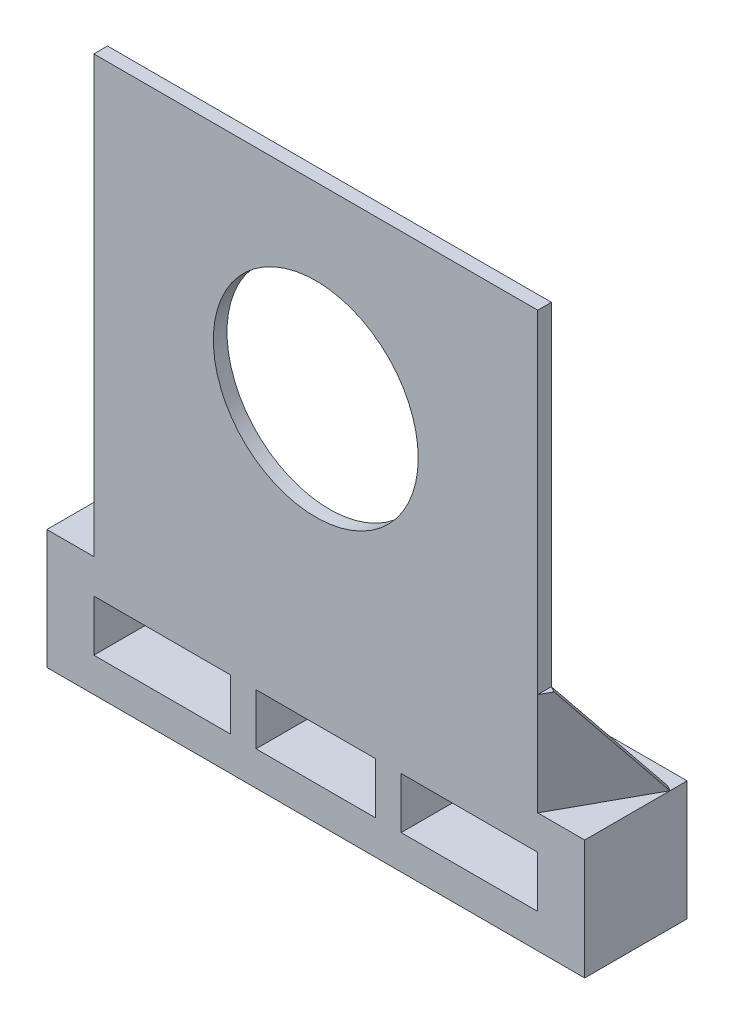
ISO-10303-21;
HEADER;
FILE_DESCRIPTION(('STEP AP214'),'2;1');
FILE_NAME('part.step','',(''),(''),'','','');
FILE_SCHEMA(('AUTOMOTIVE_DESIGN { 1 0 10303 214 1 1 1 1 }'));
ENDSEC;
DATA;
#1=APPLICATION_CONTEXT('core data for automotive mechanical design processes');
#2=APPLICATION_PROTOCOL_DEFINITION('international standard','automotive_design',2000,#1);
#3=PRODUCT_CONTEXT('',#1,'mechanical');
#4=PRODUCT('Part','Part','',(#3));
#5=PRODUCT_RELATED_PRODUCT_CATEGORY('part','',(#4));
#6=PRODUCT_DEFINITION_FORMATION('','',#4);
#7=PRODUCT_DEFINITION_CONTEXT('part definition',#1,'design');
#8=PRODUCT_DEFINITION('design','',#6,#7);
#9=PRODUCT_DEFINITION_SHAPE('','',#8);
#10=(LENGTH_UNIT() NAMED_UNIT(*) SI_UNIT(.MILLI.,.METRE.));
#11=(NAMED_UNIT(*) PLANE_ANGLE_UNIT() SI_UNIT($,.RADIAN.));
#12=(NAMED_UNIT(*) SI_UNIT($,.STERADIAN.) SOLID_ANGLE_UNIT());
#13=UNCERTAINTY_MEASURE_WITH_UNIT(LENGTH_MEASURE(1.E-05),#10,'distance_accuracy_value','');
#14=(GEOMETRIC_REPRESENTATION_CONTEXT(3) GLOBAL_UNCERTAINTY_ASSIGNED_CONTEXT((#13)) GLOBAL_UNIT_ASSIGNED_CONTEXT((#10,
#11,#12)) REPRESENTATION_CONTEXT('',''));
#15=CARTESIAN_POINT('',(0.,0.,0.));
#16=DIRECTION('',(0.,0.,1.));
#17=DIRECTION('',(1.,0.,0.));
#18=AXIS2_PLACEMENT_3D('',#15,#16,#17);
#19=CARTESIAN_POINT('',(157.5,-127.5,-60.));
#20=DIRECTION('',(0.,1.,0.));
#21=DIRECTION('',(0.,0.,1.));
#22=AXIS2_PLACEMENT_3D('',#19,#20,#21);
#23=PLANE('',#22);
#24=DIRECTION('',(-1.,0.,0.));
#25=VECTOR('',#24,1.);
#26=CARTESIAN_POINT('',(157.5,-127.5,0.));
#27=LINE('',#26,#25);
#28=CARTESIAN_POINT('',(-130.,-127.5,0.));
#29=VERTEX_POINT('',#28);
#30=CARTESIAN_POINT('',(-157.5,-127.5,0.));
#31=VERTEX_POINT('',#30);
#32=EDGE_CURVE('E225',#29,#31,#27,.T.);
#33=ORIENTED_EDGE('',*,*,#32,.F.);
#34=DIRECTION('',(-0.481918749772155,0.,-0.876215908676647));
#35=VECTOR('',#34,1.);
#36=CARTESIAN_POINT('',(-130.,-127.5,0.));
#37=LINE('',#36,#35);
#38=CARTESIAN_POINT('',(-157.5,-127.5,-50.));
#39=VERTEX_POINT('',#38);
#40=EDGE_CURVE('E210',#29,#39,#37,.T.);
#41=ORIENTED_EDGE('',*,*,#40,.T.);
#42=DIRECTION('',(0.,0.,1.));
#43=VECTOR('',#42,1.);
#44=CARTESIAN_POINT('',(-157.5,-127.5,-60.));
#45=LINE('',#44,#43);
#46=EDGE_CURVE('E223',#39,#31,#45,.T.);
#47=ORIENTED_EDGE('',*,*,#46,.T.);
#48=EDGE_LOOP('',(#33,#41,#47));
#49=FACE_BOUND('',#48,.T.);
#50=ADVANCED_FACE('F37',(#49),#23,.T.);
#51=DIRECTION('',(0.876215908676648,0.,-0.481918749772155));
#52=VECTOR('',#51,1.);
#53=CARTESIAN_POINT('',(-154.121880998081,-127.5,-51.8579654510557));
#54=LINE('',#53,#52);
#55=CARTESIAN_POINT('',(-154.121880998081,-127.5,-51.8579654510557));
#56=VERTEX_POINT('',#55);
#57=EDGE_CURVE('E201',#39,#56,#54,.T.);
#58=ORIENTED_EDGE('',*,*,#57,.T.);
#59=DIRECTION('',(0.481918749772155,0.,0.876215908676647));
#60=VECTOR('',#59,1.);
#61=CARTESIAN_POINT('',(-130.,-127.5,-8.));
#62=LINE('',#61,#60);
#63=CARTESIAN_POINT('',(-130.,-127.5,-8.));
#64=VERTEX_POINT('',#63);
#65=EDGE_CURVE('E209',#56,#64,#62,.T.);
#66=ORIENTED_EDGE('',*,*,#65,.T.);
#67=DIRECTION('',(1.,0.,0.));
#68=VECTOR('',#67,1.);
#69=CARTESIAN_POINT('',(-130.,-127.5,-8.));
#70=LINE('',#69,#68);
#71=CARTESIAN_POINT('',(130.,-127.5,-8.));
#72=VERTEX_POINT('',#71);
#73=EDGE_CURVE('E270',#64,#72,#70,.T.);
#74=ORIENTED_EDGE('',*,*,#73,.T.);
#75=DIRECTION('',(-0.481918749772155,0.,0.876215908676647));
#76=VECTOR('',#75,1.);
#77=CARTESIAN_POINT('',(130.,-127.5,-8.));
#78=LINE('',#77,#76);
#79=CARTESIAN_POINT('',(154.121880998081,-127.5,-51.8579654510557));
#80=VERTEX_POINT('',#79);
#81=EDGE_CURVE('E302',#80,#72,#78,.T.);
#82=ORIENTED_EDGE('',*,*,#81,.F.);
#83=DIRECTION('',(-0.876215908676648,0.,-0.481918749772155));
#84=VECTOR('',#83,1.);
#85=CARTESIAN_POINT('',(154.121880998081,-127.5,-51.8579654510557));
#86=LINE('',#85,#84);
#87=CARTESIAN_POINT('',(157.5,-127.5,-50.));
#88=VERTEX_POINT('',#87);
#89=EDGE_CURVE('E332',#88,#80,#86,.T.);
#90=ORIENTED_EDGE('',*,*,#89,.F.);
#91=DIRECTION('',(0.,0.,1.));
#92=VECTOR('',#91,1.);
#93=CARTESIAN_POINT('',(157.5,-127.5,-60.));
#94=LINE('',#93,#92);
#95=CARTESIAN_POINT('',(157.5,-127.5,-60.));
#96=VERTEX_POINT('',#95);
#97=EDGE_CURVE('E237',#96,#88,#94,.T.);
#98=ORIENTED_EDGE('',*,*,#97,.F.);
#99=DIRECTION('',(-1.,0.,0.));
#100=VECTOR('',#99,1.);
#101=CARTESIAN_POINT('',(157.5,-127.5,-60.));
#102=LINE('',#101,#100);
#103=CARTESIAN_POINT('',(-157.5,-127.5,-60.));
#104=VERTEX_POINT('',#103);
#105=EDGE_CURVE('E241',#96,#104,#102,.T.);
#106=ORIENTED_EDGE('',*,*,#105,.T.);
#107=EDGE_CURVE('E233',#104,#39,#45,.T.);
#108=ORIENTED_EDGE('',*,*,#107,.T.);
#109=EDGE_LOOP('',(#58,#66,#74,#82,#90,#98,#106,#108));
#110=FACE_BOUND('',#109,.T.);
#111=ADVANCED_FACE('F239',(#110),#23,.T.);
#112=CARTESIAN_POINT('',(-130.,-127.5,-8.));
#113=DIRECTION('',(-1.,0.,0.));
#114=DIRECTION('',(0.,0.,1.));
#115=AXIS2_PLACEMENT_3D('',#112,#113,#114);
#116=PLANE('',#115);
#117=DIRECTION('',(0.,-1.,0.));
#118=VECTOR('',#117,1.);
#119=CARTESIAN_POINT('',(-130.,-127.5,-8.));
#120=LINE('',#119,#118);
#121=CARTESIAN_POINT('',(-130.,127.5,-8.));
#122=VERTEX_POINT('',#121);
#123=CARTESIAN_POINT('',(-130.,-67.5,-8.00000000000004));
#124=VERTEX_POINT('',#123);
#125=EDGE_CURVE('E267',#122,#124,#120,.T.);
#126=ORIENTED_EDGE('',*,*,#125,.T.);
#127=DIRECTION('',(0.,0.,1.));
#128=VECTOR('',#127,1.);
#129=CARTESIAN_POINT('',(-130.,-67.5,0.));
#130=LINE('',#129,#128);
#131=CARTESIAN_POINT('',(-130.,-67.5,0.));
#132=VERTEX_POINT('',#131);
#133=EDGE_CURVE('E452',#124,#132,#130,.T.);
#134=ORIENTED_EDGE('',*,*,#133,.T.);
#135=DIRECTION('',(0.,-1.,0.));
#136=VECTOR('',#135,1.);
#137=CARTESIAN_POINT('',(-130.,-127.5,0.));
#138=LINE('',#137,#136);
#139=CARTESIAN_POINT('',(-130.,127.5,0.));
#140=VERTEX_POINT('',#139);
#141=EDGE_CURVE('E280',#140,#132,#138,.T.);
#142=ORIENTED_EDGE('',*,*,#141,.F.);
#143=DIRECTION('',(0.,0.,1.));
#144=VECTOR('',#143,1.);
#145=CARTESIAN_POINT('',(-130.,127.5,-8.));
#146=LINE('',#145,#144);
#147=EDGE_CURVE('E283',#122,#140,#146,.T.);
#148=ORIENTED_EDGE('',*,*,#147,.F.);
#149=EDGE_LOOP('',(#126,#134,#142,#148));
#150=FACE_BOUND('',#149,.T.);
#151=ADVANCED_FACE('F465',(#150),#116,.T.);
#152=CARTESIAN_POINT('',(-130.179391323672,-177.5,-60.));
#153=DIRECTION('',(0.,-1.,0.));
#154=DIRECTION('',(1.,0.,0.));
#155=AXIS2_PLACEMENT_3D('',#152,#153,#154);
#156=PLANE('',#155);
#157=DIRECTION('',(0.,0.,1.));
#158=VECTOR('',#157,1.);
#159=CARTESIAN_POINT('',(-130.,-177.5,-60.));
#160=LINE('',#159,#158);
#161=CARTESIAN_POINT('',(-130.,-177.5,-60.));
#162=VERTEX_POINT('',#161);
#163=CARTESIAN_POINT('',(-130.,-177.5,0.));
#164=VERTEX_POINT('',#163);
#165=EDGE_CURVE('E439',#162,#164,#160,.T.);
#166=ORIENTED_EDGE('',*,*,#165,.T.);
#167=DIRECTION('',(1.,0.,0.));
#168=VECTOR('',#167,1.);
#169=CARTESIAN_POINT('',(-130.179391323672,-177.5,0.));
#170=LINE('',#169,#168);
#171=CARTESIAN_POINT('',(-50.,-177.5,0.));
#172=VERTEX_POINT('',#171);
#173=EDGE_CURVE('E345',#164,#172,#170,.T.);
#174=ORIENTED_EDGE('',*,*,#173,.T.);
#175=DIRECTION('',(0.,0.,1.));
#176=VECTOR('',#175,1.);
#177=CARTESIAN_POINT('',(-50.,-177.5,-60.));
#178=LINE('',#177,#176);
#179=CARTESIAN_POINT('',(-50.,-177.5,-60.));
#180=VERTEX_POINT('',#179);
#181=EDGE_CURVE('E355',#180,#172,#178,.T.);
#182=ORIENTED_EDGE('',*,*,#181,.F.);
#183=DIRECTION('',(1.,0.,0.));
#184=VECTOR('',#183,1.);
#185=CARTESIAN_POINT('',(-130.179391323672,-177.5,-60.));
#186=LINE('',#185,#184);
#187=EDGE_CURVE('E59',#162,#180,#186,.T.);
#188=ORIENTED_EDGE('',*,*,#187,.F.);
#189=EDGE_LOOP('',(#166,#174,#182,#188));
#190=FACE_BOUND('',#189,.T.);
#191=ADVANCED_FACE('F467',(#190),#156,.F.);
#192=CARTESIAN_POINT('',(-130.179391323672,-147.5,-60.));
#193=DIRECTION('',(0.,1.,0.));
#194=DIRECTION('',(0.,0.,1.));
#195=AXIS2_PLACEMENT_3D('',#192,#193,#194);
#196=PLANE('',#195);
#197=DIRECTION('',(0.,0.,1.));
#198=VECTOR('',#197,1.);
#199=CARTESIAN_POINT('',(-130.,-147.5,-60.));
#200=LINE('',#199,#198);
#201=CARTESIAN_POINT('',(-130.,-147.5,-60.));
#202=VERTEX_POINT('',#201);
#203=CARTESIAN_POINT('',(-130.,-147.5,0.));
#204=VERTEX_POINT('',#203);
#205=EDGE_CURVE('E441',#202,#204,#200,.T.);
#206=ORIENTED_EDGE('',*,*,#205,.F.);
#207=DIRECTION('',(-1.,0.,0.));
#208=VECTOR('',#207,1.);
#209=CARTESIAN_POINT('',(-130.179391323672,-147.5,-60.));
#210=LINE('',#209,#208);
#211=CARTESIAN_POINT('',(-50.,-147.5,-60.));
#212=VERTEX_POINT('',#211);
#213=EDGE_CURVE('E344',#212,#202,#210,.T.);
#214=ORIENTED_EDGE('',*,*,#213,.F.);
#215=DIRECTION('',(0.,0.,1.));
#216=VECTOR('',#215,1.);
#217=CARTESIAN_POINT('',(-50.,-147.5,-60.));
#218=LINE('',#217,#216);
#219=CARTESIAN_POINT('',(-50.,-147.5,0.));
#220=VERTEX_POINT('',#219);
#221=EDGE_CURVE('E349',#212,#220,#218,.T.);
#222=ORIENTED_EDGE('',*,*,#221,.T.);
#223=DIRECTION('',(-1.,0.,0.));
#224=VECTOR('',#223,1.);
#225=CARTESIAN_POINT('',(-130.179391323672,-147.5,0.));
#226=LINE('',#225,#224);
#227=EDGE_CURVE('E352',#220,#204,#226,.T.);
#228=ORIENTED_EDGE('',*,*,#227,.T.);
#229=EDGE_LOOP('',(#206,#214,#222,#228));
#230=FACE_BOUND('',#229,.T.);
#231=ADVANCED_FACE('F473',(#230),#196,.F.);
#232=CARTESIAN_POINT('',(130.,-127.5,-8.));
#233=DIRECTION('',(1.,0.,0.));
#234=DIRECTION('',(0.,0.,-1.));
#235=AXIS2_PLACEMENT_3D('',#232,#233,#234);
#236=PLANE('',#235);
#237=DIRECTION('',(0.,1.,0.));
#238=VECTOR('',#237,1.);
#239=CARTESIAN_POINT('',(130.,-127.5,0.));
#240=LINE('',#239,#238);
#241=CARTESIAN_POINT('',(130.,-67.5,0.));
#242=VERTEX_POINT('',#241);
#243=CARTESIAN_POINT('',(130.,127.5,0.));
#244=VERTEX_POINT('',#243);
#245=EDGE_CURVE('E258',#242,#244,#240,.T.);
#246=ORIENTED_EDGE('',*,*,#245,.F.);
#247=DIRECTION('',(0.,0.,1.));
#248=VECTOR('',#247,1.);
#249=CARTESIAN_POINT('',(130.,-67.5,0.));
#250=LINE('',#249,#248);
#251=CARTESIAN_POINT('',(130.,-67.5,-8.));
#252=VERTEX_POINT('',#251);
#253=EDGE_CURVE('E292',#252,#242,#250,.T.);
#254=ORIENTED_EDGE('',*,*,#253,.F.);
#255=DIRECTION('',(0.,1.,0.));
#256=VECTOR('',#255,1.);
#257=CARTESIAN_POINT('',(130.,-127.5,-8.));
#258=LINE('',#257,#256);
#259=CARTESIAN_POINT('',(130.,127.5,-8.));
#260=VERTEX_POINT('',#259);
#261=EDGE_CURVE('E264',#252,#260,#258,.T.);
#262=ORIENTED_EDGE('',*,*,#261,.T.);
#263=DIRECTION('',(0.,0.,1.));
#264=VECTOR('',#263,1.);
#265=CARTESIAN_POINT('',(130.,127.5,-8.));
#266=LINE('',#265,#264);
#267=EDGE_CURVE('E273',#260,#244,#266,.T.);
#268=ORIENTED_EDGE('',*,*,#267,.T.);
#269=EDGE_LOOP('',(#246,#254,#262,#268));
#270=FACE_BOUND('',#269,.T.);
#271=ADVANCED_FACE('F39',(#270),#236,.T.);
#272=CARTESIAN_POINT('',(157.5,-127.5,0.));
#273=VERTEX_POINT('',#272);
#274=EDGE_CURVE('E252',#88,#273,#94,.T.);
#275=ORIENTED_EDGE('',*,*,#274,.F.);
#276=DIRECTION('',(0.481918749772155,0.,-0.876215908676647));
#277=VECTOR('',#276,1.);
#278=CARTESIAN_POINT('',(130.,-127.5,0.));
#279=LINE('',#278,#277);
#280=CARTESIAN_POINT('',(130.,-127.5,0.));
#281=VERTEX_POINT('',#280);
#282=EDGE_CURVE('E327',#281,#88,#279,.T.);
#283=ORIENTED_EDGE('',*,*,#282,.F.);
#284=EDGE_CURVE('E248',#273,#281,#27,.T.);
#285=ORIENTED_EDGE('',*,*,#284,.F.);
#286=EDGE_LOOP('',(#275,#283,#285));
#287=FACE_BOUND('',#286,.T.);
#288=ADVANCED_FACE('F331',(#287),#23,.T.);
#289=CARTESIAN_POINT('',(-130.,127.5,-8.));
#290=DIRECTION('',(0.,1.,0.));
#291=DIRECTION('',(0.,0.,1.));
#292=AXIS2_PLACEMENT_3D('',#289,#290,#291);
#293=PLANE('',#292);
#294=DIRECTION('',(-1.,0.,0.));
#295=VECTOR('',#294,1.);
#296=CARTESIAN_POINT('',(-130.,127.5,0.));
#297=LINE('',#296,#295);
#298=EDGE_CURVE('E277',#244,#140,#297,.T.);
#299=ORIENTED_EDGE('',*,*,#298,.F.);
#300=ORIENTED_EDGE('',*,*,#267,.F.);
#301=DIRECTION('',(-1.,0.,0.));
#302=VECTOR('',#301,1.);
#303=CARTESIAN_POINT('',(-130.,127.5,-8.));
#304=LINE('',#303,#302);
#305=EDGE_CURVE('E263',#260,#122,#304,.T.);
#306=ORIENTED_EDGE('',*,*,#305,.T.);
#307=ORIENTED_EDGE('',*,*,#147,.T.);
#308=EDGE_LOOP('',(#299,#300,#306,#307));
#309=FACE_BOUND('',#308,.T.);
#310=ADVANCED_FACE('F315',(#309),#293,.T.);
#311=CARTESIAN_POINT('',(0.,0.,-8.));
#312=DIRECTION('',(0.,0.,-1.));
#313=DIRECTION('',(-1.,0.,0.));
#314=AXIS2_PLACEMENT_3D('',#311,#312,#313);
#315=PLANE('',#314);
#316=CARTESIAN_POINT('',(0.,17.5,-8.));
#317=DIRECTION('',(0.,0.,1.));
#318=DIRECTION('',(1.,0.,0.));
#319=AXIS2_PLACEMENT_3D('',#316,#317,#318);
#320=CIRCLE('',#319,60.);
#321=CARTESIAN_POINT('',(60.,17.5,-8.));
#322=VERTEX_POINT('',#321);
#323=EDGE_CURVE('E244',#322,#322,#320,.T.);
#324=ORIENTED_EDGE('',*,*,#323,.T.);
#325=EDGE_LOOP('',(#324));
#326=FACE_BOUND('',#325,.T.);
#327=EDGE_CURVE('E260',#72,#252,#258,.T.);
#328=ORIENTED_EDGE('',*,*,#327,.F.);
#329=ORIENTED_EDGE('',*,*,#73,.F.);
#330=DIRECTION('',(0.,1.,0.));
#331=VECTOR('',#330,1.);
#332=CARTESIAN_POINT('',(-130.,-127.5,-8.));
#333=LINE('',#332,#331);
#334=EDGE_CURVE('E333',#64,#124,#333,.T.);
#335=ORIENTED_EDGE('',*,*,#334,.T.);
#336=ORIENTED_EDGE('',*,*,#125,.F.);
#337=ORIENTED_EDGE('',*,*,#305,.F.);
#338=ORIENTED_EDGE('',*,*,#261,.F.);
#339=EDGE_LOOP('',(#328,#329,#335,#336,#337,#338));
#340=FACE_BOUND('',#339,.T.);
#341=ADVANCED_FACE('F310',(#326,#340),#315,.T.);
#342=CARTESIAN_POINT('',(0.,0.,0.));
#343=DIRECTION('',(0.,0.,-1.));
#344=DIRECTION('',(-1.,0.,0.));
#345=AXIS2_PLACEMENT_3D('',#342,#343,#344);
#346=PLANE('',#345);
#347=DIRECTION('',(0.,1.,0.));
#348=VECTOR('',#347,1.);
#349=CARTESIAN_POINT('',(130.,-177.5,0.));
#350=LINE('',#349,#348);
#351=CARTESIAN_POINT('',(130.,-177.5,0.));
#352=VERTEX_POINT('',#351);
#353=CARTESIAN_POINT('',(130.,-147.5,0.));
#354=VERTEX_POINT('',#353);
#355=EDGE_CURVE('E358',#352,#354,#350,.T.);
#356=ORIENTED_EDGE('',*,*,#355,.F.);
#357=DIRECTION('',(1.,0.,0.));
#358=VECTOR('',#357,1.);
#359=CARTESIAN_POINT('',(50.,-177.5,0.));
#360=LINE('',#359,#358);
#361=CARTESIAN_POINT('',(50.,-177.5,0.));
#362=VERTEX_POINT('',#361);
#363=EDGE_CURVE('E365',#362,#352,#360,.T.);
#364=ORIENTED_EDGE('',*,*,#363,.F.);
#365=DIRECTION('',(0.,-1.,0.));
#366=VECTOR('',#365,1.);
#367=CARTESIAN_POINT('',(50.,-177.5,0.));
#368=LINE('',#367,#366);
#369=CARTESIAN_POINT('',(50.,-147.5,0.));
#370=VERTEX_POINT('',#369);
#371=EDGE_CURVE('E379',#370,#362,#368,.T.);
#372=ORIENTED_EDGE('',*,*,#371,.F.);
#373=DIRECTION('',(-1.,0.,0.));
#374=VECTOR('',#373,1.);
#375=CARTESIAN_POINT('',(50.,-147.5,0.));
#376=LINE('',#375,#374);
#377=EDGE_CURVE('E376',#354,#370,#376,.T.);
#378=ORIENTED_EDGE('',*,*,#377,.F.);
#379=EDGE_LOOP('',(#356,#364,#372,#378));
#380=FACE_BOUND('',#379,.T.);
#381=ORIENTED_EDGE('',*,*,#173,.F.);
#382=DIRECTION('',(0.,1.,0.));
#383=VECTOR('',#382,1.);
#384=CARTESIAN_POINT('',(-130.,-177.5,0.));
#385=LINE('',#384,#383);
#386=EDGE_CURVE('E447',#164,#204,#385,.T.);
#387=ORIENTED_EDGE('',*,*,#386,.T.);
#388=ORIENTED_EDGE('',*,*,#227,.F.);
#389=DIRECTION('',(0.,1.,0.));
#390=VECTOR('',#389,1.);
#391=CARTESIAN_POINT('',(-50.,-177.5,0.));
#392=LINE('',#391,#390);
#393=EDGE_CURVE('E350',#172,#220,#392,.T.);
#394=ORIENTED_EDGE('',*,*,#393,.F.);
#395=EDGE_LOOP('',(#381,#387,#388,#394));
#396=FACE_BOUND('',#395,.T.);
#397=CARTESIAN_POINT('',(0.,17.5,0.));
#398=DIRECTION('',(0.,0.,1.));
#399=DIRECTION('',(1.,0.,0.));
#400=AXIS2_PLACEMENT_3D('',#397,#398,#399);
#401=CIRCLE('',#400,60.);
#402=CARTESIAN_POINT('',(60.,17.5,0.));
#403=VERTEX_POINT('',#402);
#404=EDGE_CURVE('E242',#403,#403,#401,.T.);
#405=ORIENTED_EDGE('',*,*,#404,.F.);
#406=EDGE_LOOP('',(#405));
#407=FACE_BOUND('',#406,.T.);
#408=EDGE_CURVE('E274',#281,#242,#240,.T.);
#409=ORIENTED_EDGE('',*,*,#408,.T.);
#410=ORIENTED_EDGE('',*,*,#245,.T.);
#411=ORIENTED_EDGE('',*,*,#298,.T.);
#412=ORIENTED_EDGE('',*,*,#141,.T.);
#413=DIRECTION('',(0.,1.,0.));
#414=VECTOR('',#413,1.);
#415=CARTESIAN_POINT('',(-130.,-127.5,0.));
#416=LINE('',#415,#414);
#417=EDGE_CURVE('E336',#29,#132,#416,.T.);
#418=ORIENTED_EDGE('',*,*,#417,.F.);
#419=ORIENTED_EDGE('',*,*,#32,.T.);
#420=DIRECTION('',(0.,-1.,0.));
#421=VECTOR('',#420,1.);
#422=CARTESIAN_POINT('',(-157.5,-197.5,0.));
#423=LINE('',#422,#421);
#424=CARTESIAN_POINT('',(-157.5,-197.5,0.));
#425=VERTEX_POINT('',#424);
#426=EDGE_CURVE('E236',#31,#425,#423,.T.);
#427=ORIENTED_EDGE('',*,*,#426,.T.);
#428=DIRECTION('',(1.,0.,0.));
#429=VECTOR('',#428,1.);
#430=CARTESIAN_POINT('',(157.5,-197.5,0.));
#431=LINE('',#430,#429);
#432=CARTESIAN_POINT('',(157.5,-197.5,0.));
#433=VERTEX_POINT('',#432);
#434=EDGE_CURVE('E434',#425,#433,#431,.T.);
#435=ORIENTED_EDGE('',*,*,#434,.T.);
#436=DIRECTION('',(0.,1.,0.));
#437=VECTOR('',#436,1.);
#438=CARTESIAN_POINT('',(157.5,-197.5,0.));
#439=LINE('',#438,#437);
#440=EDGE_CURVE('E436',#433,#273,#439,.T.);
#441=ORIENTED_EDGE('',*,*,#440,.T.);
#442=ORIENTED_EDGE('',*,*,#284,.T.);
#443=EDGE_LOOP('',(#409,#410,#411,#412,#418,#419,#427,#435,#441,#442));
#444=FACE_BOUND('',#443,.T.);
#445=DIRECTION('',(0.,1.,0.));
#446=VECTOR('',#445,1.);
#447=CARTESIAN_POINT('',(35.,-177.5,0.));
#448=LINE('',#447,#446);
#449=CARTESIAN_POINT('',(35.,-177.5,0.));
#450=VERTEX_POINT('',#449);
#451=CARTESIAN_POINT('',(35.,-147.5,0.));
#452=VERTEX_POINT('',#451);
#453=EDGE_CURVE('E386',#450,#452,#448,.T.);
#454=ORIENTED_EDGE('',*,*,#453,.F.);
#455=DIRECTION('',(1.,0.,0.));
#456=VECTOR('',#455,1.);
#457=CARTESIAN_POINT('',(-35.,-177.5,0.));
#458=LINE('',#457,#456);
#459=CARTESIAN_POINT('',(-35.,-177.5,0.));
#460=VERTEX_POINT('',#459);
#461=EDGE_CURVE('E397',#460,#450,#458,.T.);
#462=ORIENTED_EDGE('',*,*,#461,.F.);
#463=DIRECTION('',(0.,-1.,0.));
#464=VECTOR('',#463,1.);
#465=CARTESIAN_POINT('',(-35.,-177.5,0.));
#466=LINE('',#465,#464);
#467=CARTESIAN_POINT('',(-35.,-147.5,0.));
#468=VERTEX_POINT('',#467);
#469=EDGE_CURVE('E411',#468,#460,#466,.T.);
#470=ORIENTED_EDGE('',*,*,#469,.F.);
#471=DIRECTION('',(-1.,0.,0.));
#472=VECTOR('',#471,1.);
#473=CARTESIAN_POINT('',(-35.,-147.5,0.));
#474=LINE('',#473,#472);
#475=EDGE_CURVE('E408',#452,#468,#474,.T.);
#476=ORIENTED_EDGE('',*,*,#475,.F.);
#477=EDGE_LOOP('',(#454,#462,#470,#476));
#478=FACE_BOUND('',#477,.T.);
#479=ADVANCED_FACE('F318',(#380,#396,#407,#444,#478),#346,.F.);
#480=CARTESIAN_POINT('',(0.,17.5,-8.));
#481=DIRECTION('',(0.,0.,1.));
#482=DIRECTION('',(1.,0.,0.));
#483=AXIS2_PLACEMENT_3D('',#480,#481,#482);
#484=CYLINDRICAL_SURFACE('',#483,60.);
#485=ORIENTED_EDGE('',*,*,#323,.F.);
#486=EDGE_LOOP('',(#485));
#487=FACE_BOUND('',#486,.T.);
#488=ORIENTED_EDGE('',*,*,#404,.T.);
#489=EDGE_LOOP('',(#488));
#490=FACE_BOUND('',#489,.T.);
#491=ADVANCED_FACE('F655',(#487,#490),#484,.F.);
#492=CARTESIAN_POINT('',(-157.5,-197.5,-60.));
#493=DIRECTION('',(-1.,0.,0.));
#494=DIRECTION('',(0.,0.,1.));
#495=AXIS2_PLACEMENT_3D('',#492,#493,#494);
#496=PLANE('',#495);
#497=ORIENTED_EDGE('',*,*,#426,.F.);
#498=ORIENTED_EDGE('',*,*,#46,.F.);
#499=ORIENTED_EDGE('',*,*,#107,.F.);
#500=DIRECTION('',(0.,-1.,0.));
#501=VECTOR('',#500,1.);
#502=CARTESIAN_POINT('',(-157.5,-197.5,-60.));
#503=LINE('',#502,#501);
#504=CARTESIAN_POINT('',(-157.5,-197.5,-60.));
#505=VERTEX_POINT('',#504);
#506=EDGE_CURVE('E424',#104,#505,#503,.T.);
#507=ORIENTED_EDGE('',*,*,#506,.T.);
#508=DIRECTION('',(0.,0.,1.));
#509=VECTOR('',#508,1.);
#510=CARTESIAN_POINT('',(-157.5,-197.5,-60.));
#511=LINE('',#510,#509);
#512=EDGE_CURVE('E255',#505,#425,#511,.T.);
#513=ORIENTED_EDGE('',*,*,#512,.T.);
#514=EDGE_LOOP('',(#497,#498,#499,#507,#513));
#515=FACE_BOUND('',#514,.T.);
#516=ADVANCED_FACE('F231',(#515),#496,.T.);
#517=CARTESIAN_POINT('',(157.5,-197.5,-60.));
#518=DIRECTION('',(1.,0.,0.));
#519=DIRECTION('',(0.,0.,-1.));
#520=AXIS2_PLACEMENT_3D('',#517,#518,#519);
#521=PLANE('',#520);
#522=ORIENTED_EDGE('',*,*,#440,.F.);
#523=DIRECTION('',(0.,0.,1.));
#524=VECTOR('',#523,1.);
#525=CARTESIAN_POINT('',(157.5,-197.5,-60.));
#526=LINE('',#525,#524);
#527=CARTESIAN_POINT('',(157.5,-197.5,-60.));
#528=VERTEX_POINT('',#527);
#529=EDGE_CURVE('E253',#528,#433,#526,.T.);
#530=ORIENTED_EDGE('',*,*,#529,.F.);
#531=DIRECTION('',(0.,1.,0.));
#532=VECTOR('',#531,1.);
#533=CARTESIAN_POINT('',(157.5,-197.5,-60.));
#534=LINE('',#533,#532);
#535=EDGE_CURVE('E429',#528,#96,#534,.T.);
#536=ORIENTED_EDGE('',*,*,#535,.T.);
#537=ORIENTED_EDGE('',*,*,#97,.T.);
#538=ORIENTED_EDGE('',*,*,#274,.T.);
#539=EDGE_LOOP('',(#522,#530,#536,#537,#538));
#540=FACE_BOUND('',#539,.T.);
#541=ADVANCED_FACE('F538',(#540),#521,.T.);
#542=CARTESIAN_POINT('',(157.5,-197.5,-60.));
#543=DIRECTION('',(0.,-1.,0.));
#544=DIRECTION('',(1.,0.,0.));
#545=AXIS2_PLACEMENT_3D('',#542,#543,#544);
#546=PLANE('',#545);
#547=ORIENTED_EDGE('',*,*,#434,.F.);
#548=ORIENTED_EDGE('',*,*,#512,.F.);
#549=DIRECTION('',(1.,0.,0.));
#550=VECTOR('',#549,1.);
#551=CARTESIAN_POINT('',(157.5,-197.5,-60.));
#552=LINE('',#551,#550);
#553=EDGE_CURVE('E426',#505,#528,#552,.T.);
#554=ORIENTED_EDGE('',*,*,#553,.T.);
#555=ORIENTED_EDGE('',*,*,#529,.T.);
#556=EDGE_LOOP('',(#547,#548,#554,#555));
#557=FACE_BOUND('',#556,.T.);
#558=ADVANCED_FACE('F533',(#557),#546,.T.);
#559=CARTESIAN_POINT('',(0.,0.,-60.));
#560=DIRECTION('',(0.,0.,1.));
#561=DIRECTION('',(1.,0.,0.));
#562=AXIS2_PLACEMENT_3D('',#559,#560,#561);
#563=PLANE('',#562);
#564=DIRECTION('',(0.,1.,0.));
#565=VECTOR('',#564,1.);
#566=CARTESIAN_POINT('',(-130.,-177.5,-60.));
#567=LINE('',#566,#565);
#568=EDGE_CURVE('E445',#162,#202,#567,.T.);
#569=ORIENTED_EDGE('',*,*,#568,.F.);
#570=ORIENTED_EDGE('',*,*,#187,.T.);
#571=DIRECTION('',(0.,1.,0.));
#572=VECTOR('',#571,1.);
#573=CARTESIAN_POINT('',(-50.,-177.5,-60.));
#574=LINE('',#573,#572);
#575=EDGE_CURVE('E341',#180,#212,#574,.T.);
#576=ORIENTED_EDGE('',*,*,#575,.T.);
#577=ORIENTED_EDGE('',*,*,#213,.T.);
#578=EDGE_LOOP('',(#569,#570,#576,#577));
#579=FACE_BOUND('',#578,.T.);
#580=DIRECTION('',(1.,0.,0.));
#581=VECTOR('',#580,1.);
#582=CARTESIAN_POINT('',(50.,-177.5,-60.));
#583=LINE('',#582,#581);
#584=CARTESIAN_POINT('',(50.,-177.5,-60.));
#585=VERTEX_POINT('',#584);
#586=CARTESIAN_POINT('',(130.,-177.5,-60.));
#587=VERTEX_POINT('',#586);
#588=EDGE_CURVE('E371',#585,#587,#583,.T.);
#589=ORIENTED_EDGE('',*,*,#588,.T.);
#590=DIRECTION('',(0.,1.,0.));
#591=VECTOR('',#590,1.);
#592=CARTESIAN_POINT('',(130.,-177.5,-60.));
#593=LINE('',#592,#591);
#594=CARTESIAN_POINT('',(130.,-147.5,-60.));
#595=VERTEX_POINT('',#594);
#596=EDGE_CURVE('E361',#587,#595,#593,.T.);
#597=ORIENTED_EDGE('',*,*,#596,.T.);
#598=DIRECTION('',(-1.,0.,0.));
#599=VECTOR('',#598,1.);
#600=CARTESIAN_POINT('',(50.,-147.5,-60.));
#601=LINE('',#600,#599);
#602=CARTESIAN_POINT('',(50.,-147.5,-60.));
#603=VERTEX_POINT('',#602);
#604=EDGE_CURVE('E364',#595,#603,#601,.T.);
#605=ORIENTED_EDGE('',*,*,#604,.T.);
#606=DIRECTION('',(0.,-1.,0.));
#607=VECTOR('',#606,1.);
#608=CARTESIAN_POINT('',(50.,-177.5,-60.));
#609=LINE('',#608,#607);
#610=EDGE_CURVE('E368',#603,#585,#609,.T.);
#611=ORIENTED_EDGE('',*,*,#610,.T.);
#612=EDGE_LOOP('',(#589,#597,#605,#611));
#613=FACE_BOUND('',#612,.T.);
#614=DIRECTION('',(1.,0.,0.));
#615=VECTOR('',#614,1.);
#616=CARTESIAN_POINT('',(-35.,-177.5,-60.));
#617=LINE('',#616,#615);
#618=CARTESIAN_POINT('',(-35.,-177.5,-60.));
#619=VERTEX_POINT('',#618);
#620=CARTESIAN_POINT('',(35.,-177.5,-60.));
#621=VERTEX_POINT('',#620);
#622=EDGE_CURVE('E403',#619,#621,#617,.T.);
#623=ORIENTED_EDGE('',*,*,#622,.T.);
#624=DIRECTION('',(0.,1.,0.));
#625=VECTOR('',#624,1.);
#626=CARTESIAN_POINT('',(35.,-177.5,-60.));
#627=LINE('',#626,#625);
#628=CARTESIAN_POINT('',(35.,-147.5,-60.));
#629=VERTEX_POINT('',#628);
#630=EDGE_CURVE('E393',#621,#629,#627,.T.);
#631=ORIENTED_EDGE('',*,*,#630,.T.);
#632=DIRECTION('',(-1.,0.,0.));
#633=VECTOR('',#632,1.);
#634=CARTESIAN_POINT('',(-35.,-147.5,-60.));
#635=LINE('',#634,#633);
#636=CARTESIAN_POINT('',(-35.,-147.5,-60.));
#637=VERTEX_POINT('',#636);
#638=EDGE_CURVE('E396',#629,#637,#635,.T.);
#639=ORIENTED_EDGE('',*,*,#638,.T.);
#640=DIRECTION('',(0.,-1.,0.));
#641=VECTOR('',#640,1.);
#642=CARTESIAN_POINT('',(-35.,-177.5,-60.));
#643=LINE('',#642,#641);
#644=EDGE_CURVE('E400',#637,#619,#643,.T.);
#645=ORIENTED_EDGE('',*,*,#644,.T.);
#646=EDGE_LOOP('',(#623,#631,#639,#645));
#647=FACE_BOUND('',#646,.T.);
#648=ORIENTED_EDGE('',*,*,#506,.F.);
#649=ORIENTED_EDGE('',*,*,#105,.F.);
#650=ORIENTED_EDGE('',*,*,#535,.F.);
#651=ORIENTED_EDGE('',*,*,#553,.F.);
#652=EDGE_LOOP('',(#648,#649,#650,#651));
#653=FACE_BOUND('',#652,.T.);
#654=ADVANCED_FACE('F530',(#579,#613,#647,#653),#563,.F.);
#655=CARTESIAN_POINT('',(35.,-177.5,-60.));
#656=DIRECTION('',(1.,0.,0.));
#657=DIRECTION('',(0.,0.,-1.));
#658=AXIS2_PLACEMENT_3D('',#655,#656,#657);
#659=PLANE('',#658);
#660=ORIENTED_EDGE('',*,*,#453,.T.);
#661=DIRECTION('',(0.,0.,1.));
#662=VECTOR('',#661,1.);
#663=CARTESIAN_POINT('',(35.,-147.5,-60.));
#664=LINE('',#663,#662);
#665=EDGE_CURVE('E406',#629,#452,#664,.T.);
#666=ORIENTED_EDGE('',*,*,#665,.F.);
#667=ORIENTED_EDGE('',*,*,#630,.F.);
#668=DIRECTION('',(0.,0.,1.));
#669=VECTOR('',#668,1.);
#670=CARTESIAN_POINT('',(35.,-177.5,-60.));
#671=LINE('',#670,#669);
#672=EDGE_CURVE('E416',#621,#450,#671,.T.);
#673=ORIENTED_EDGE('',*,*,#672,.T.);
#674=EDGE_LOOP('',(#660,#666,#667,#673));
#675=FACE_BOUND('',#674,.T.);
#676=ADVANCED_FACE('F521',(#675),#659,.F.);
#677=CARTESIAN_POINT('',(-35.,-177.5,-60.));
#678=DIRECTION('',(0.,-1.,0.));
#679=DIRECTION('',(0.,0.,-1.));
#680=AXIS2_PLACEMENT_3D('',#677,#678,#679);
#681=PLANE('',#680);
#682=ORIENTED_EDGE('',*,*,#461,.T.);
#683=ORIENTED_EDGE('',*,*,#672,.F.);
#684=ORIENTED_EDGE('',*,*,#622,.F.);
#685=DIRECTION('',(0.,0.,1.));
#686=VECTOR('',#685,1.);
#687=CARTESIAN_POINT('',(-35.,-177.5,-60.));
#688=LINE('',#687,#686);
#689=EDGE_CURVE('E418',#619,#460,#688,.T.);
#690=ORIENTED_EDGE('',*,*,#689,.T.);
#691=EDGE_LOOP('',(#682,#683,#684,#690));
#692=FACE_BOUND('',#691,.T.);
#693=ADVANCED_FACE('F517',(#692),#681,.F.);
#694=CARTESIAN_POINT('',(-35.,-177.5,-60.));
#695=DIRECTION('',(-1.,0.,0.));
#696=DIRECTION('',(0.,0.,1.));
#697=AXIS2_PLACEMENT_3D('',#694,#695,#696);
#698=PLANE('',#697);
#699=ORIENTED_EDGE('',*,*,#469,.T.);
#700=ORIENTED_EDGE('',*,*,#689,.F.);
#701=ORIENTED_EDGE('',*,*,#644,.F.);
#702=DIRECTION('',(0.,0.,1.));
#703=VECTOR('',#702,1.);
#704=CARTESIAN_POINT('',(-35.,-147.5,-60.));
#705=LINE('',#704,#703);
#706=EDGE_CURVE('E420',#637,#468,#705,.T.);
#707=ORIENTED_EDGE('',*,*,#706,.T.);
#708=EDGE_LOOP('',(#699,#700,#701,#707));
#709=FACE_BOUND('',#708,.T.);
#710=ADVANCED_FACE('F520',(#709),#698,.F.);
#711=CARTESIAN_POINT('',(-35.,-147.5,-60.));
#712=DIRECTION('',(0.,1.,0.));
#713=DIRECTION('',(0.,0.,1.));
#714=AXIS2_PLACEMENT_3D('',#711,#712,#713);
#715=PLANE('',#714);
#716=ORIENTED_EDGE('',*,*,#475,.T.);
#717=ORIENTED_EDGE('',*,*,#706,.F.);
#718=ORIENTED_EDGE('',*,*,#638,.F.);
#719=ORIENTED_EDGE('',*,*,#665,.T.);
#720=EDGE_LOOP('',(#716,#717,#718,#719));
#721=FACE_BOUND('',#720,.T.);
#722=ADVANCED_FACE('F515',(#721),#715,.F.);
#723=CARTESIAN_POINT('',(130.,-177.5,-60.));
#724=DIRECTION('',(1.,0.,0.));
#725=DIRECTION('',(0.,0.,-1.));
#726=AXIS2_PLACEMENT_3D('',#723,#724,#725);
#727=PLANE('',#726);
#728=ORIENTED_EDGE('',*,*,#355,.T.);
#729=DIRECTION('',(0.,0.,1.));
#730=VECTOR('',#729,1.);
#731=CARTESIAN_POINT('',(130.,-147.5,-60.));
#732=LINE('',#731,#730);
#733=EDGE_CURVE('E374',#595,#354,#732,.T.);
#734=ORIENTED_EDGE('',*,*,#733,.F.);
#735=ORIENTED_EDGE('',*,*,#596,.F.);
#736=DIRECTION('',(0.,0.,1.));
#737=VECTOR('',#736,1.);
#738=CARTESIAN_POINT('',(130.,-177.5,-60.));
#739=LINE('',#738,#737);
#740=EDGE_CURVE('E384',#587,#352,#739,.T.);
#741=ORIENTED_EDGE('',*,*,#740,.T.);
#742=EDGE_LOOP('',(#728,#734,#735,#741));
#743=FACE_BOUND('',#742,.T.);
#744=ADVANCED_FACE('F505',(#743),#727,.F.);
#745=CARTESIAN_POINT('',(50.,-177.5,-60.));
#746=DIRECTION('',(0.,-1.,0.));
#747=DIRECTION('',(0.,0.,-1.));
#748=AXIS2_PLACEMENT_3D('',#745,#746,#747);
#749=PLANE('',#748);
#750=ORIENTED_EDGE('',*,*,#363,.T.);
#751=ORIENTED_EDGE('',*,*,#740,.F.);
#752=ORIENTED_EDGE('',*,*,#588,.F.);
#753=DIRECTION('',(0.,0.,1.));
#754=VECTOR('',#753,1.);
#755=CARTESIAN_POINT('',(50.,-177.5,-60.));
#756=LINE('',#755,#754);
#757=EDGE_CURVE('E387',#585,#362,#756,.T.);
#758=ORIENTED_EDGE('',*,*,#757,.T.);
#759=EDGE_LOOP('',(#750,#751,#752,#758));
#760=FACE_BOUND('',#759,.T.);
#761=ADVANCED_FACE('F501',(#760),#749,.F.);
#762=CARTESIAN_POINT('',(50.,-177.5,-60.));
#763=DIRECTION('',(-1.,0.,0.));
#764=DIRECTION('',(0.,0.,1.));
#765=AXIS2_PLACEMENT_3D('',#762,#763,#764);
#766=PLANE('',#765);
#767=ORIENTED_EDGE('',*,*,#371,.T.);
#768=ORIENTED_EDGE('',*,*,#757,.F.);
#769=ORIENTED_EDGE('',*,*,#610,.F.);
#770=DIRECTION('',(0.,0.,1.));
#771=VECTOR('',#770,1.);
#772=CARTESIAN_POINT('',(50.,-147.5,-60.));
#773=LINE('',#772,#771);
#774=EDGE_CURVE('E389',#603,#370,#773,.T.);
#775=ORIENTED_EDGE('',*,*,#774,.T.);
#776=EDGE_LOOP('',(#767,#768,#769,#775));
#777=FACE_BOUND('',#776,.T.);
#778=ADVANCED_FACE('F504',(#777),#766,.F.);
#779=CARTESIAN_POINT('',(50.,-147.5,-60.));
#780=DIRECTION('',(0.,1.,0.));
#781=DIRECTION('',(0.,0.,1.));
#782=AXIS2_PLACEMENT_3D('',#779,#780,#781);
#783=PLANE('',#782);
#784=ORIENTED_EDGE('',*,*,#377,.T.);
#785=ORIENTED_EDGE('',*,*,#774,.F.);
#786=ORIENTED_EDGE('',*,*,#604,.F.);
#787=ORIENTED_EDGE('',*,*,#733,.T.);
#788=EDGE_LOOP('',(#784,#785,#786,#787));
#789=FACE_BOUND('',#788,.T.);
#790=ADVANCED_FACE('F499',(#789),#783,.F.);
#791=CARTESIAN_POINT('',(-50.,-177.5,-60.));
#792=DIRECTION('',(1.,0.,0.));
#793=DIRECTION('',(0.,0.,-1.));
#794=AXIS2_PLACEMENT_3D('',#791,#792,#793);
#795=PLANE('',#794);
#796=ORIENTED_EDGE('',*,*,#393,.T.);
#797=ORIENTED_EDGE('',*,*,#221,.F.);
#798=ORIENTED_EDGE('',*,*,#575,.F.);
#799=ORIENTED_EDGE('',*,*,#181,.T.);
#800=EDGE_LOOP('',(#796,#797,#798,#799));
#801=FACE_BOUND('',#800,.T.);
#802=ADVANCED_FACE('F496',(#801),#795,.F.);
#803=CARTESIAN_POINT('',(130.,-67.5,0.));
#804=DIRECTION('',(-0.876215908676647,0.,-0.481918749772155));
#805=DIRECTION('',(-0.481918749772156,0.,0.876215908676647));
#806=AXIS2_PLACEMENT_3D('',#803,#804,#805);
#807=PLANE('',#806);
#808=ORIENTED_EDGE('',*,*,#282,.T.);
#809=DIRECTION('',(0.308712772093156,-0.767882335837045,-0.561295949260284));
#810=VECTOR('',#809,1.);
#811=CARTESIAN_POINT('',(133.378119001919,-67.5,-6.14203454894433));
#812=LINE('',#811,#810);
#813=CARTESIAN_POINT('',(133.378119001919,-67.5,-6.14203454894433));
#814=VERTEX_POINT('',#813);
#815=EDGE_CURVE('E457',#814,#88,#812,.T.);
#816=ORIENTED_EDGE('',*,*,#815,.F.);
#817=DIRECTION('',(0.481918749772155,0.,-0.876215908676647));
#818=VECTOR('',#817,1.);
#819=CARTESIAN_POINT('',(130.,-67.5,0.));
#820=LINE('',#819,#818);
#821=EDGE_CURVE('E294',#242,#814,#820,.T.);
#822=ORIENTED_EDGE('',*,*,#821,.F.);
#823=ORIENTED_EDGE('',*,*,#408,.F.);
#824=EDGE_LOOP('',(#808,#816,#822,#823));
#825=FACE_BOUND('',#824,.T.);
#826=ADVANCED_FACE('F326',(#825),#807,.F.);
#827=CARTESIAN_POINT('',(130.,-67.5,-8.));
#828=DIRECTION('',(0.876215908676647,0.,0.481918749772155));
#829=DIRECTION('',(0.481918749772155,0.,-0.876215908676647));
#830=AXIS2_PLACEMENT_3D('',#827,#828,#829);
#831=PLANE('',#830);
#832=ORIENTED_EDGE('',*,*,#327,.T.);
#833=DIRECTION('',(0.308712772093156,-0.767882335837045,-0.561295949260284));
#834=VECTOR('',#833,1.);
#835=CARTESIAN_POINT('',(130.,-67.5,-8.00000000000001));
#836=LINE('',#835,#834);
#837=EDGE_CURVE('E226',#252,#80,#836,.T.);
#838=ORIENTED_EDGE('',*,*,#837,.T.);
#839=ORIENTED_EDGE('',*,*,#81,.T.);
#840=EDGE_LOOP('',(#832,#838,#839));
#841=FACE_BOUND('',#840,.T.);
#842=ADVANCED_FACE('F300',(#841),#831,.F.);
#843=CARTESIAN_POINT('',(0.,-67.5,0.));
#844=DIRECTION('',(0.,-1.,0.));
#845=DIRECTION('',(0.,0.,-1.));
#846=AXIS2_PLACEMENT_3D('',#843,#844,#845);
#847=PLANE('',#846);
#848=ORIENTED_EDGE('',*,*,#821,.T.);
#849=DIRECTION('',(-0.876215908676647,0.,-0.481918749772156));
#850=VECTOR('',#849,1.);
#851=CARTESIAN_POINT('',(33.5700575815739,-67.5,-61.0364683301344));
#852=LINE('',#851,#850);
#853=EDGE_CURVE('E45',#814,#252,#852,.T.);
#854=ORIENTED_EDGE('',*,*,#853,.T.);
#855=ORIENTED_EDGE('',*,*,#253,.T.);
#856=EDGE_LOOP('',(#848,#854,#855));
#857=FACE_BOUND('',#856,.T.);
#858=ADVANCED_FACE('F290',(#857),#847,.F.);
#859=CARTESIAN_POINT('',(-130.,-177.5,-60.));
#860=DIRECTION('',(-1.,0.,0.));
#861=DIRECTION('',(0.,0.,-1.));
#862=AXIS2_PLACEMENT_3D('',#859,#860,#861);
#863=PLANE('',#862);
#864=ORIENTED_EDGE('',*,*,#386,.F.);
#865=ORIENTED_EDGE('',*,*,#165,.F.);
#866=ORIENTED_EDGE('',*,*,#568,.T.);
#867=ORIENTED_EDGE('',*,*,#205,.T.);
#868=EDGE_LOOP('',(#864,#865,#866,#867));
#869=FACE_BOUND('',#868,.T.);
#870=ADVANCED_FACE('F565',(#869),#863,.F.);
#871=CARTESIAN_POINT('',(-130.,-67.5,0.));
#872=DIRECTION('',(0.876215908676647,0.,-0.481918749772155));
#873=DIRECTION('',(0.481918749772156,0.,0.876215908676647));
#874=AXIS2_PLACEMENT_3D('',#871,#872,#873);
#875=PLANE('',#874);
#876=DIRECTION('',(-0.481918749772155,0.,-0.876215908676647));
#877=VECTOR('',#876,1.);
#878=CARTESIAN_POINT('',(-130.,-67.5,0.));
#879=LINE('',#878,#877);
#880=CARTESIAN_POINT('',(-133.378119001919,-67.5,-6.14203454894437));
#881=VERTEX_POINT('',#880);
#882=EDGE_CURVE('E218',#132,#881,#879,.T.);
#883=ORIENTED_EDGE('',*,*,#882,.T.);
#884=DIRECTION('',(0.308712772093156,0.767882335837045,0.561295949260284));
#885=VECTOR('',#884,1.);
#886=CARTESIAN_POINT('',(-133.378119001919,-67.5,-6.14203454894433));
#887=LINE('',#886,#885);
#888=EDGE_CURVE('E52',#39,#881,#887,.T.);
#889=ORIENTED_EDGE('',*,*,#888,.F.);
#890=ORIENTED_EDGE('',*,*,#40,.F.);
#891=ORIENTED_EDGE('',*,*,#417,.T.);
#892=EDGE_LOOP('',(#883,#889,#890,#891));
#893=FACE_BOUND('',#892,.T.);
#894=ADVANCED_FACE('F215',(#893),#875,.F.);
#895=CARTESIAN_POINT('',(-130.,-67.5,-8.));
#896=DIRECTION('',(-0.876215908676647,0.,0.481918749772155));
#897=DIRECTION('',(-0.481918749772155,0.,-0.876215908676647));
#898=AXIS2_PLACEMENT_3D('',#895,#896,#897);
#899=PLANE('',#898);
#900=ORIENTED_EDGE('',*,*,#65,.F.);
#901=DIRECTION('',(0.308712772093156,0.767882335837045,0.561295949260284));
#902=VECTOR('',#901,1.);
#903=CARTESIAN_POINT('',(-130.,-67.5,-8.));
#904=LINE('',#903,#902);
#905=EDGE_CURVE('E204',#56,#124,#904,.T.);
#906=ORIENTED_EDGE('',*,*,#905,.T.);
#907=ORIENTED_EDGE('',*,*,#334,.F.);
#908=EDGE_LOOP('',(#900,#906,#907));
#909=FACE_BOUND('',#908,.T.);
#910=ADVANCED_FACE('F461',(#909),#899,.F.);
#911=CARTESIAN_POINT('',(0.,-67.5,0.));
#912=DIRECTION('',(0.,-1.,0.));
#913=DIRECTION('',(0.,0.,-1.));
#914=AXIS2_PLACEMENT_3D('',#911,#912,#913);
#915=PLANE('',#914);
#916=ORIENTED_EDGE('',*,*,#133,.F.);
#917=DIRECTION('',(-0.876215908676647,0.,0.481918749772156));
#918=VECTOR('',#917,1.);
#919=CARTESIAN_POINT('',(-33.5700575815739,-67.5,-61.0364683301343));
#920=LINE('',#919,#918);
#921=EDGE_CURVE('E11',#124,#881,#920,.T.);
#922=ORIENTED_EDGE('',*,*,#921,.T.);
#923=ORIENTED_EDGE('',*,*,#882,.F.);
#924=EDGE_LOOP('',(#916,#922,#923));
#925=FACE_BOUND('',#924,.T.);
#926=ADVANCED_FACE('F463',(#925),#915,.F.);
#927=CARTESIAN_POINT('',(-112.687140115163,-67.5,-141.47792706334));
#928=DIRECTION('',(-0.370056895258711,-0.640590913383451,0.672830718652202));
#929=DIRECTION('',(0.,-0.724245568700915,-0.689542135200663));
#930=AXIS2_PLACEMENT_3D('',#927,#928,#929);
#931=PLANE('',#930);
#932=ORIENTED_EDGE('',*,*,#853,.F.);
#933=ORIENTED_EDGE('',*,*,#815,.T.);
#934=ORIENTED_EDGE('',*,*,#89,.T.);
#935=ORIENTED_EDGE('',*,*,#837,.F.);
#936=EDGE_LOOP('',(#932,#933,#934,#935));
#937=FACE_BOUND('',#936,.T.);
#938=ADVANCED_FACE('F551',(#937),#931,.F.);
#939=CARTESIAN_POINT('',(112.687140115163,-67.5,-141.47792706334));
#940=DIRECTION('',(0.370056895258711,-0.640590913383451,0.672830718652202));
#941=DIRECTION('',(0.,-0.724245568700915,-0.689542135200663));
#942=AXIS2_PLACEMENT_3D('',#939,#940,#941);
#943=PLANE('',#942);
#944=ORIENTED_EDGE('',*,*,#57,.F.);
#945=ORIENTED_EDGE('',*,*,#888,.T.);
#946=ORIENTED_EDGE('',*,*,#921,.F.);
#947=ORIENTED_EDGE('',*,*,#905,.F.);
#948=EDGE_LOOP('',(#944,#945,#946,#947));
#949=FACE_BOUND('',#948,.T.);
#950=ADVANCED_FACE('F202',(#949),#943,.F.);
#951=CLOSED_SHELL('',(#50,#111,#151,#191,#231,#271,#288,#310,#341,#479,#491,#516,#541,#558,#654,
#676,#693,#710,#722,#744,#761,#778,#790,#802,#826,#842,#858,#870,#894,#910,#926,#938,#950));
#952=MANIFOLD_SOLID_BREP('B2',#951);
#953=ADVANCED_BREP_SHAPE_REPRESENTATION('',(#18,#952),#14);
#954=SHAPE_DEFINITION_REPRESENTATION(#9,#953);
ENDSEC;
END-ISO-10303-21;
